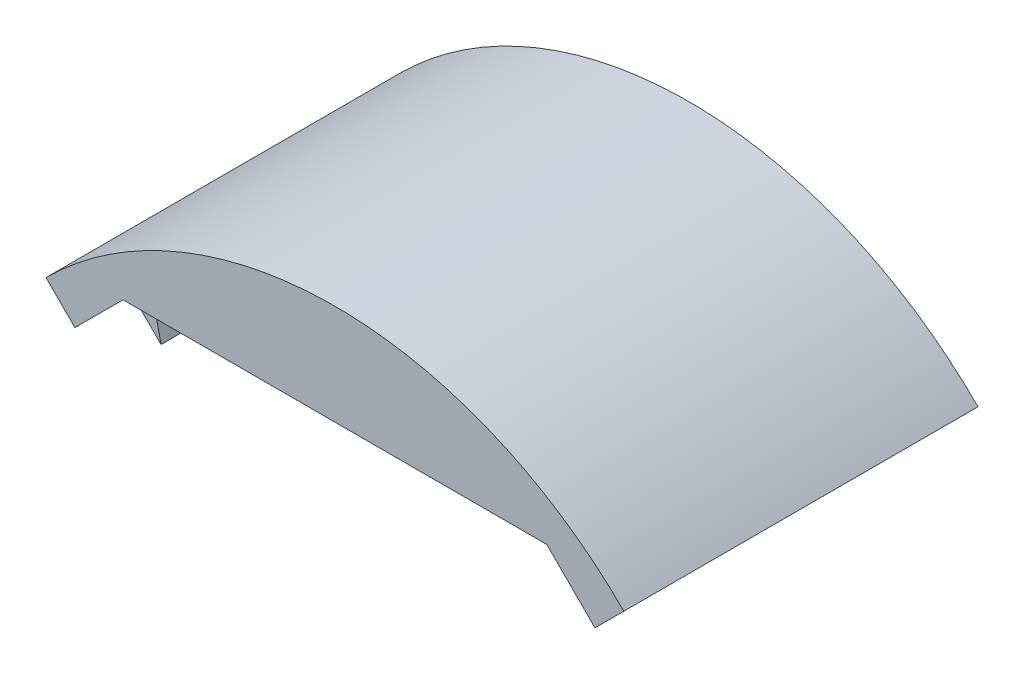
ISO-10303-21;
HEADER;
FILE_DESCRIPTION(('STEP AP214'),'2;1');
FILE_NAME('part.step','',(''),(''),'','','');
FILE_SCHEMA(('AUTOMOTIVE_DESIGN { 1 0 10303 214 1 1 1 1 }'));
ENDSEC;
DATA;
#1=APPLICATION_CONTEXT('core data for automotive mechanical design processes');
#2=APPLICATION_PROTOCOL_DEFINITION('international standard','automotive_design',2000,#1);
#3=PRODUCT_CONTEXT('',#1,'mechanical');
#4=PRODUCT('Part','Part','',(#3));
#5=PRODUCT_RELATED_PRODUCT_CATEGORY('part','',(#4));
#6=PRODUCT_DEFINITION_FORMATION('','',#4);
#7=PRODUCT_DEFINITION_CONTEXT('part definition',#1,'design');
#8=PRODUCT_DEFINITION('design','',#6,#7);
#9=PRODUCT_DEFINITION_SHAPE('','',#8);
#10=(LENGTH_UNIT() NAMED_UNIT(*) SI_UNIT(.MILLI.,.METRE.));
#11=(NAMED_UNIT(*) PLANE_ANGLE_UNIT() SI_UNIT($,.RADIAN.));
#12=(NAMED_UNIT(*) SI_UNIT($,.STERADIAN.) SOLID_ANGLE_UNIT());
#13=UNCERTAINTY_MEASURE_WITH_UNIT(LENGTH_MEASURE(1.E-05),#10,'distance_accuracy_value','');
#14=(GEOMETRIC_REPRESENTATION_CONTEXT(3) GLOBAL_UNCERTAINTY_ASSIGNED_CONTEXT((#13)) GLOBAL_UNIT_ASSIGNED_CONTEXT((#10,
#11,#12)) REPRESENTATION_CONTEXT('',''));
#15=CARTESIAN_POINT('',(0.,0.,0.));
#16=DIRECTION('',(0.,0.,1.));
#17=DIRECTION('',(1.,0.,0.));
#18=AXIS2_PLACEMENT_3D('',#15,#16,#17);
#19=CARTESIAN_POINT('',(0.,-19.5161471607487,64.0741382042982));
#20=DIRECTION('',(0.,0.,-1.));
#21=DIRECTION('',(-0.707106781186548,-0.707106781186547,0.));
#22=AXIS2_PLACEMENT_3D('',#19,#20,#21);
#23=CYLINDRICAL_SURFACE('',#22,25.8);
#24=DIRECTION('',(0.,0.,-1.));
#25=VECTOR('',#24,1.);
#26=CARTESIAN_POINT('',(-18.2433549546129,-1.27279220613579,64.0741382042982));
#27=LINE('',#26,#25);
#28=CARTESIAN_POINT('',(-18.2433549546129,-1.2727922061358,18.7));
#29=VERTEX_POINT('',#28);
#30=CARTESIAN_POINT('',(-18.2433549546129,-1.2727922061358,7.3));
#31=VERTEX_POINT('',#30);
#32=EDGE_CURVE('E382',#29,#31,#27,.T.);
#33=ORIENTED_EDGE('',*,*,#32,.T.);
#34=CARTESIAN_POINT('',(0.,-19.5161471607487,7.3));
#35=DIRECTION('',(0.,0.,-1.));
#36=DIRECTION('',(-0.707106781186548,0.707106781186547,0.));
#37=AXIS2_PLACEMENT_3D('',#34,#35,#36);
#38=CIRCLE('',#37,25.8);
#39=CARTESIAN_POINT('',(-17.300942303206,-0.376727226457697,7.3));
#40=VERTEX_POINT('',#39);
#41=EDGE_CURVE('E236',#31,#40,#38,.T.);
#42=ORIENTED_EDGE('',*,*,#41,.T.);
#43=DIRECTION('',(0.,0.,-1.));
#44=VECTOR('',#43,1.);
#45=CARTESIAN_POINT('',(-17.300942303206,-0.376727226457697,7.3));
#46=LINE('',#45,#44);
#47=CARTESIAN_POINT('',(-17.300942303206,-0.376727226457697,3.5));
#48=VERTEX_POINT('',#47);
#49=EDGE_CURVE('E404',#40,#48,#46,.T.);
#50=ORIENTED_EDGE('',*,*,#49,.T.);
#51=CARTESIAN_POINT('',(0.,-19.5161471607487,3.5));
#52=DIRECTION('',(0.,0.,-1.));
#53=DIRECTION('',(-0.707106781186548,0.707106781186547,0.));
#54=AXIS2_PLACEMENT_3D('',#51,#52,#53);
#55=CIRCLE('',#54,25.8);
#56=CARTESIAN_POINT('',(-18.2433549546129,-1.2727922061358,3.5));
#57=VERTEX_POINT('',#56);
#58=EDGE_CURVE('E388',#57,#48,#55,.T.);
#59=ORIENTED_EDGE('',*,*,#58,.F.);
#60=CARTESIAN_POINT('',(-18.2433549546129,-1.27279220613579,2.2));
#61=VERTEX_POINT('',#60);
#62=EDGE_CURVE('E371',#57,#61,#27,.T.);
#63=ORIENTED_EDGE('',*,*,#62,.T.);
#64=CARTESIAN_POINT('',(0.,-19.5161471607487,2.2));
#65=DIRECTION('',(0.,0.,1.));
#66=DIRECTION('',(0.707106781186548,0.707106781186547,0.));
#67=AXIS2_PLACEMENT_3D('',#64,#65,#66);
#68=CIRCLE('',#67,25.8);
#69=CARTESIAN_POINT('',(18.2433549546129,-1.27279220613579,2.2));
#70=VERTEX_POINT('',#69);
#71=EDGE_CURVE('E354',#70,#61,#68,.T.);
#72=ORIENTED_EDGE('',*,*,#71,.F.);
#73=DIRECTION('',(0.,0.,-1.));
#74=VECTOR('',#73,1.);
#75=CARTESIAN_POINT('',(18.2433549546129,-1.27279220613579,64.0741382042982));
#76=LINE('',#75,#74);
#77=CARTESIAN_POINT('',(18.2433549546129,-1.27279220613579,3.5));
#78=VERTEX_POINT('',#77);
#79=EDGE_CURVE('E373',#78,#70,#76,.T.);
#80=ORIENTED_EDGE('',*,*,#79,.F.);
#81=CARTESIAN_POINT('',(0.,-19.5161471607487,3.5));
#82=DIRECTION('',(0.,0.,1.));
#83=DIRECTION('',(0.707106781186548,0.707106781186547,0.));
#84=AXIS2_PLACEMENT_3D('',#81,#82,#83);
#85=CIRCLE('',#84,25.8);
#86=CARTESIAN_POINT('',(17.300942303206,-0.376727226457679,3.5));
#87=VERTEX_POINT('',#86);
#88=EDGE_CURVE('E457',#78,#87,#85,.T.);
#89=ORIENTED_EDGE('',*,*,#88,.T.);
#90=DIRECTION('',(0.,0.,-1.));
#91=VECTOR('',#90,1.);
#92=CARTESIAN_POINT('',(17.300942303206,-0.376727226457686,7.3));
#93=LINE('',#92,#91);
#94=CARTESIAN_POINT('',(17.300942303206,-0.376727226457683,7.3));
#95=VERTEX_POINT('',#94);
#96=EDGE_CURVE('E460',#95,#87,#93,.T.);
#97=ORIENTED_EDGE('',*,*,#96,.F.);
#98=CARTESIAN_POINT('',(0.,-19.5161471607487,7.3));
#99=DIRECTION('',(0.,0.,1.));
#100=DIRECTION('',(0.707106781186548,0.707106781186547,0.));
#101=AXIS2_PLACEMENT_3D('',#98,#99,#100);
#102=CIRCLE('',#101,25.8);
#103=CARTESIAN_POINT('',(18.2433549546129,-1.27279220613579,7.3));
#104=VERTEX_POINT('',#103);
#105=EDGE_CURVE('E443',#104,#95,#102,.T.);
#106=ORIENTED_EDGE('',*,*,#105,.F.);
#107=CARTESIAN_POINT('',(18.2433549546129,-1.27279220613579,18.7));
#108=VERTEX_POINT('',#107);
#109=EDGE_CURVE('E372',#108,#104,#76,.T.);
#110=ORIENTED_EDGE('',*,*,#109,.F.);
#111=CARTESIAN_POINT('',(0.,-19.5161471607487,18.7));
#112=DIRECTION('',(0.,0.,1.));
#113=DIRECTION('',(0.707106781186548,0.707106781186547,0.));
#114=AXIS2_PLACEMENT_3D('',#111,#112,#113);
#115=CIRCLE('',#114,25.8);
#116=CARTESIAN_POINT('',(17.300942303206,-0.376727226457683,18.7));
#117=VERTEX_POINT('',#116);
#118=EDGE_CURVE('E473',#108,#117,#115,.T.);
#119=ORIENTED_EDGE('',*,*,#118,.T.);
#120=DIRECTION('',(0.,0.,1.));
#121=VECTOR('',#120,1.);
#122=CARTESIAN_POINT('',(17.300942303206,-0.376727226457686,18.7));
#123=LINE('',#122,#121);
#124=CARTESIAN_POINT('',(17.300942303206,-0.376727226457686,22.5));
#125=VERTEX_POINT('',#124);
#126=EDGE_CURVE('E363',#117,#125,#123,.T.);
#127=ORIENTED_EDGE('',*,*,#126,.T.);
#128=CARTESIAN_POINT('',(0.,-19.5161471607487,22.5));
#129=DIRECTION('',(0.,0.,1.));
#130=DIRECTION('',(0.707106781186548,0.707106781186547,0.));
#131=AXIS2_PLACEMENT_3D('',#128,#129,#130);
#132=CIRCLE('',#131,25.8);
#133=CARTESIAN_POINT('',(18.2433549546129,-1.27279220613579,22.5));
#134=VERTEX_POINT('',#133);
#135=EDGE_CURVE('E486',#134,#125,#132,.T.);
#136=ORIENTED_EDGE('',*,*,#135,.F.);
#137=CARTESIAN_POINT('',(18.2433549546129,-1.27279220613579,24.));
#138=VERTEX_POINT('',#137);
#139=EDGE_CURVE('E366',#138,#134,#76,.T.);
#140=ORIENTED_EDGE('',*,*,#139,.F.);
#141=CARTESIAN_POINT('',(0.,-19.5161471607487,24.));
#142=DIRECTION('',(0.,0.,1.));
#143=DIRECTION('',(0.707106781186548,0.707106781186547,0.));
#144=AXIS2_PLACEMENT_3D('',#141,#142,#143);
#145=CIRCLE('',#144,25.8);
#146=CARTESIAN_POINT('',(-18.2433549546129,-1.27279220613579,24.));
#147=VERTEX_POINT('',#146);
#148=EDGE_CURVE('E357',#138,#147,#145,.T.);
#149=ORIENTED_EDGE('',*,*,#148,.T.);
#150=CARTESIAN_POINT('',(-18.2433549546129,-1.27279220613579,22.5));
#151=VERTEX_POINT('',#150);
#152=EDGE_CURVE('E262',#147,#151,#27,.T.);
#153=ORIENTED_EDGE('',*,*,#152,.T.);
#154=CARTESIAN_POINT('',(0.,-19.5161471607487,22.5));
#155=DIRECTION('',(0.,0.,-1.));
#156=DIRECTION('',(-0.707106781186548,0.707106781186547,0.));
#157=AXIS2_PLACEMENT_3D('',#154,#155,#156);
#158=CIRCLE('',#157,25.8);
#159=CARTESIAN_POINT('',(-17.300942303206,-0.376727226457697,22.5));
#160=VERTEX_POINT('',#159);
#161=EDGE_CURVE('E41',#151,#160,#158,.T.);
#162=ORIENTED_EDGE('',*,*,#161,.T.);
#163=DIRECTION('',(0.,0.,1.));
#164=VECTOR('',#163,1.);
#165=CARTESIAN_POINT('',(-17.300942303206,-0.376727226457697,18.7));
#166=LINE('',#165,#164);
#167=CARTESIAN_POINT('',(-17.300942303206,-0.376727226457697,18.7));
#168=VERTEX_POINT('',#167);
#169=EDGE_CURVE('E426',#168,#160,#166,.T.);
#170=ORIENTED_EDGE('',*,*,#169,.F.);
#171=CARTESIAN_POINT('',(0.,-19.5161471607487,18.7));
#172=DIRECTION('',(0.,0.,-1.));
#173=DIRECTION('',(-0.707106781186548,0.707106781186547,0.));
#174=AXIS2_PLACEMENT_3D('',#171,#172,#173);
#175=CIRCLE('',#174,25.8);
#176=EDGE_CURVE('E414',#29,#168,#175,.T.);
#177=ORIENTED_EDGE('',*,*,#176,.F.);
#178=EDGE_LOOP('',(#33,#42,#50,#59,#63,#72,#80,#89,#97,#106,#110,#119,#127,#136,#140,#149,#153,
#162,#170,#177));
#179=FACE_BOUND('',#178,.T.);
#180=ADVANCED_FACE('F18',(#179),#23,.F.);
#181=CARTESIAN_POINT('',(-19.0918830920368,-3.53553390593274,26.));
#182=DIRECTION('',(-0.707106781186547,0.707106781186547,0.));
#183=DIRECTION('',(0.,0.,1.));
#184=AXIS2_PLACEMENT_3D('',#181,#182,#183);
#185=PLANE('',#184);
#186=DIRECTION('',(0.707106781186547,0.707106781186548,0.));
#187=VECTOR('',#186,1.);
#188=CARTESIAN_POINT('',(-17.5362481734264,-1.97989898732235,7.3));
#189=LINE('',#188,#187);
#190=CARTESIAN_POINT('',(-18.3847763108502,-2.8284271247462,7.3));
#191=VERTEX_POINT('',#190);
#192=CARTESIAN_POINT('',(-17.5362481734264,-1.97989898732235,7.3));
#193=VERTEX_POINT('',#192);
#194=EDGE_CURVE('E232',#191,#193,#189,.T.);
#195=ORIENTED_EDGE('',*,*,#194,.T.);
#196=DIRECTION('',(0.,0.,-1.));
#197=VECTOR('',#196,1.);
#198=CARTESIAN_POINT('',(-17.5362481734264,-1.97989898732234,64.0741382042982));
#199=LINE('',#198,#197);
#200=CARTESIAN_POINT('',(-17.5362481734264,-1.97989898732235,18.7));
#201=VERTEX_POINT('',#200);
#202=EDGE_CURVE('E247',#201,#193,#199,.T.);
#203=ORIENTED_EDGE('',*,*,#202,.F.);
#204=DIRECTION('',(0.707106781186547,0.707106781186548,0.));
#205=VECTOR('',#204,1.);
#206=CARTESIAN_POINT('',(-17.5362481734264,-1.97989898732235,18.7));
#207=LINE('',#206,#205);
#208=CARTESIAN_POINT('',(-18.3847763108502,-2.8284271247462,18.7));
#209=VERTEX_POINT('',#208);
#210=EDGE_CURVE('E407',#209,#201,#207,.T.);
#211=ORIENTED_EDGE('',*,*,#210,.F.);
#212=DIRECTION('',(0.,0.,1.));
#213=VECTOR('',#212,1.);
#214=CARTESIAN_POINT('',(-18.3847763108502,-2.8284271247462,18.7));
#215=LINE('',#214,#213);
#216=CARTESIAN_POINT('',(-18.3847763108502,-2.8284271247462,22.5));
#217=VERTEX_POINT('',#216);
#218=EDGE_CURVE('E417',#209,#217,#215,.T.);
#219=ORIENTED_EDGE('',*,*,#218,.T.);
#220=DIRECTION('',(0.707106781186547,0.707106781186548,0.));
#221=VECTOR('',#220,1.);
#222=CARTESIAN_POINT('',(-17.5362481734264,-1.97989898732235,22.5));
#223=LINE('',#222,#221);
#224=CARTESIAN_POINT('',(-17.5362481734264,-1.97989898732235,22.5));
#225=VERTEX_POINT('',#224);
#226=EDGE_CURVE('E401',#217,#225,#223,.T.);
#227=ORIENTED_EDGE('',*,*,#226,.T.);
#228=CARTESIAN_POINT('',(-17.5362481734264,-1.97989898732234,24.));
#229=VERTEX_POINT('',#228);
#230=EDGE_CURVE('E254',#229,#225,#199,.T.);
#231=ORIENTED_EDGE('',*,*,#230,.F.);
#232=DIRECTION('',(0.707106781186548,0.707106781186547,0.));
#233=VECTOR('',#232,1.);
#234=CARTESIAN_POINT('',(-19.0918830920368,-3.53553390593274,24.));
#235=LINE('',#234,#233);
#236=CARTESIAN_POINT('',(-15.556349186104,0.,24.));
#237=VERTEX_POINT('',#236);
#238=EDGE_CURVE('E283',#229,#237,#235,.T.);
#239=ORIENTED_EDGE('',*,*,#238,.T.);
#240=DIRECTION('',(0.,0.,-1.));
#241=VECTOR('',#240,1.);
#242=CARTESIAN_POINT('',(-15.556349186104,0.,26.));
#243=LINE('',#242,#241);
#244=CARTESIAN_POINT('',(-15.556349186104,0.,26.));
#245=VERTEX_POINT('',#244);
#246=EDGE_CURVE('E325',#245,#237,#243,.T.);
#247=ORIENTED_EDGE('',*,*,#246,.F.);
#248=DIRECTION('',(0.707106781186548,0.707106781186547,0.));
#249=VECTOR('',#248,1.);
#250=CARTESIAN_POINT('',(-19.0918830920368,-3.53553390593274,26.));
#251=LINE('',#250,#249);
#252=CARTESIAN_POINT('',(-19.0918830920368,-3.53553390593274,26.));
#253=VERTEX_POINT('',#252);
#254=EDGE_CURVE('E293',#253,#245,#251,.T.);
#255=ORIENTED_EDGE('',*,*,#254,.F.);
#256=DIRECTION('',(0.,0.,-1.));
#257=VECTOR('',#256,1.);
#258=CARTESIAN_POINT('',(-19.0918830920368,-3.53553390593274,26.));
#259=LINE('',#258,#257);
#260=CARTESIAN_POINT('',(-19.0918830920368,-3.53553390593274,0.));
#261=VERTEX_POINT('',#260);
#262=EDGE_CURVE('E26',#253,#261,#259,.T.);
#263=ORIENTED_EDGE('',*,*,#262,.T.);
#264=DIRECTION('',(0.707106781186548,0.707106781186547,0.));
#265=VECTOR('',#264,1.);
#266=CARTESIAN_POINT('',(-19.0918830920368,-3.53553390593274,0.));
#267=LINE('',#266,#265);
#268=CARTESIAN_POINT('',(-15.556349186104,0.,0.));
#269=VERTEX_POINT('',#268);
#270=EDGE_CURVE('E306',#261,#269,#267,.T.);
#271=ORIENTED_EDGE('',*,*,#270,.T.);
#272=CARTESIAN_POINT('',(-15.556349186104,0.,2.2));
#273=VERTEX_POINT('',#272);
#274=EDGE_CURVE('E324',#273,#269,#243,.T.);
#275=ORIENTED_EDGE('',*,*,#274,.F.);
#276=DIRECTION('',(0.707106781186548,0.707106781186547,0.));
#277=VECTOR('',#276,1.);
#278=CARTESIAN_POINT('',(-19.0918830920368,-3.53553390593274,2.2));
#279=LINE('',#278,#277);
#280=CARTESIAN_POINT('',(-17.5362481734264,-1.97989898732234,2.2));
#281=VERTEX_POINT('',#280);
#282=EDGE_CURVE('E275',#281,#273,#279,.T.);
#283=ORIENTED_EDGE('',*,*,#282,.F.);
#284=CARTESIAN_POINT('',(-17.5362481734264,-1.97989898732234,3.5));
#285=VERTEX_POINT('',#284);
#286=EDGE_CURVE('E255',#285,#281,#199,.T.);
#287=ORIENTED_EDGE('',*,*,#286,.F.);
#288=DIRECTION('',(0.707106781186547,0.707106781186548,0.));
#289=VECTOR('',#288,1.);
#290=CARTESIAN_POINT('',(-17.5362481734264,-1.97989898732235,3.5));
#291=LINE('',#290,#289);
#292=CARTESIAN_POINT('',(-18.3847763108502,-2.8284271247462,3.5));
#293=VERTEX_POINT('',#292);
#294=EDGE_CURVE('E33',#293,#285,#291,.T.);
#295=ORIENTED_EDGE('',*,*,#294,.F.);
#296=DIRECTION('',(0.,0.,-1.));
#297=VECTOR('',#296,1.);
#298=CARTESIAN_POINT('',(-18.3847763108502,-2.8284271247462,7.3));
#299=LINE('',#298,#297);
#300=EDGE_CURVE('E248',#191,#293,#299,.T.);
#301=ORIENTED_EDGE('',*,*,#300,.F.);
#302=EDGE_LOOP('',(#195,#203,#211,#219,#227,#231,#239,#247,#255,#263,#271,#275,#283,#287,#295,#301));
#303=FACE_BOUND('',#302,.T.);
#304=ADVANCED_FACE('F245',(#303),#185,.F.);
#305=CARTESIAN_POINT('',(1.5556349186104,-21.0717820793591,64.0741382042982));
#306=DIRECTION('',(-0.707106781186548,-0.707106781186547,0.));
#307=DIRECTION('',(0.,0.,1.));
#308=AXIS2_PLACEMENT_3D('',#305,#306,#307);
#309=PLANE('',#308);
#310=DIRECTION('',(-0.707106781186547,0.707106781186548,0.));
#311=VECTOR('',#310,1.);
#312=CARTESIAN_POINT('',(-17.5362481734264,-1.97989898732235,7.3));
#313=LINE('',#312,#311);
#314=EDGE_CURVE('E228',#193,#31,#313,.T.);
#315=ORIENTED_EDGE('',*,*,#314,.T.);
#316=ORIENTED_EDGE('',*,*,#32,.F.);
#317=DIRECTION('',(-0.707106781186547,0.707106781186548,0.));
#318=VECTOR('',#317,1.);
#319=CARTESIAN_POINT('',(-17.5362481734264,-1.97989898732235,18.7));
#320=LINE('',#319,#318);
#321=EDGE_CURVE('E253',#201,#29,#320,.T.);
#322=ORIENTED_EDGE('',*,*,#321,.F.);
#323=ORIENTED_EDGE('',*,*,#202,.T.);
#324=EDGE_LOOP('',(#315,#316,#322,#323));
#325=FACE_BOUND('',#324,.T.);
#326=ADVANCED_FACE('F252',(#325),#309,.F.);
#327=ORIENTED_EDGE('',*,*,#62,.F.);
#328=DIRECTION('',(-0.707106781186547,0.707106781186548,0.));
#329=VECTOR('',#328,1.);
#330=CARTESIAN_POINT('',(-17.5362481734264,-1.97989898732235,3.5));
#331=LINE('',#330,#329);
#332=EDGE_CURVE('E390',#285,#57,#331,.T.);
#333=ORIENTED_EDGE('',*,*,#332,.F.);
#334=ORIENTED_EDGE('',*,*,#286,.T.);
#335=DIRECTION('',(-0.707106781186547,0.707106781186548,0.));
#336=VECTOR('',#335,1.);
#337=CARTESIAN_POINT('',(1.5556349186104,-21.0717820793591,2.2));
#338=LINE('',#337,#336);
#339=EDGE_CURVE('E259',#281,#61,#338,.T.);
#340=ORIENTED_EDGE('',*,*,#339,.T.);
#341=EDGE_LOOP('',(#327,#333,#334,#340));
#342=FACE_BOUND('',#341,.T.);
#343=ADVANCED_FACE('F389',(#342),#309,.F.);
#344=CARTESIAN_POINT('',(19.0918830920368,-3.53553390593274,26.));
#345=DIRECTION('',(0.707106781186547,0.707106781186547,0.));
#346=DIRECTION('',(0.,0.,-1.));
#347=AXIS2_PLACEMENT_3D('',#344,#345,#346);
#348=PLANE('',#347);
#349=DIRECTION('',(-0.707106781186547,0.707106781186548,0.));
#350=VECTOR('',#349,1.);
#351=CARTESIAN_POINT('',(17.5362481734264,-1.97989898732234,7.3));
#352=LINE('',#351,#350);
#353=CARTESIAN_POINT('',(18.3847763108502,-2.82842712474619,7.3));
#354=VERTEX_POINT('',#353);
#355=CARTESIAN_POINT('',(17.5362481734264,-1.97989898732234,7.3));
#356=VERTEX_POINT('',#355);
#357=EDGE_CURVE('E434',#354,#356,#352,.T.);
#358=ORIENTED_EDGE('',*,*,#357,.F.);
#359=DIRECTION('',(0.,0.,-1.));
#360=VECTOR('',#359,1.);
#361=CARTESIAN_POINT('',(18.3847763108502,-2.82842712474619,7.3));
#362=LINE('',#361,#360);
#363=CARTESIAN_POINT('',(18.3847763108502,-2.82842712474619,3.5));
#364=VERTEX_POINT('',#363);
#365=EDGE_CURVE('E449',#354,#364,#362,.T.);
#366=ORIENTED_EDGE('',*,*,#365,.T.);
#367=DIRECTION('',(-0.707106781186547,0.707106781186548,0.));
#368=VECTOR('',#367,1.);
#369=CARTESIAN_POINT('',(17.5362481734264,-1.97989898732234,3.5));
#370=LINE('',#369,#368);
#371=CARTESIAN_POINT('',(17.5362481734264,-1.97989898732234,3.5));
#372=VERTEX_POINT('',#371);
#373=EDGE_CURVE('E428',#364,#372,#370,.T.);
#374=ORIENTED_EDGE('',*,*,#373,.T.);
#375=DIRECTION('',(0.,0.,-1.));
#376=VECTOR('',#375,1.);
#377=CARTESIAN_POINT('',(17.5362481734264,-1.97989898732234,64.0741382042982));
#378=LINE('',#377,#376);
#379=CARTESIAN_POINT('',(17.5362481734264,-1.97989898732234,2.2));
#380=VERTEX_POINT('',#379);
#381=EDGE_CURVE('E269',#372,#380,#378,.T.);
#382=ORIENTED_EDGE('',*,*,#381,.T.);
#383=DIRECTION('',(0.707106781186547,-0.707106781186548,0.));
#384=VECTOR('',#383,1.);
#385=CARTESIAN_POINT('',(19.0918830920368,-3.53553390593274,2.2));
#386=LINE('',#385,#384);
#387=CARTESIAN_POINT('',(15.556349186104,0.,2.2));
#388=VERTEX_POINT('',#387);
#389=EDGE_CURVE('E270',#388,#380,#386,.T.);
#390=ORIENTED_EDGE('',*,*,#389,.F.);
#391=DIRECTION('',(0.,0.,-1.));
#392=VECTOR('',#391,1.);
#393=CARTESIAN_POINT('',(15.556349186104,0.,26.));
#394=LINE('',#393,#392);
#395=CARTESIAN_POINT('',(15.556349186104,0.,0.));
#396=VERTEX_POINT('',#395);
#397=EDGE_CURVE('E320',#388,#396,#394,.T.);
#398=ORIENTED_EDGE('',*,*,#397,.T.);
#399=DIRECTION('',(0.707106781186547,-0.707106781186548,0.));
#400=VECTOR('',#399,1.);
#401=CARTESIAN_POINT('',(19.0918830920368,-3.53553390593274,0.));
#402=LINE('',#401,#400);
#403=CARTESIAN_POINT('',(19.0918830920368,-3.53553390593274,0.));
#404=VERTEX_POINT('',#403);
#405=EDGE_CURVE('E312',#396,#404,#402,.T.);
#406=ORIENTED_EDGE('',*,*,#405,.T.);
#407=DIRECTION('',(0.,0.,-1.));
#408=VECTOR('',#407,1.);
#409=CARTESIAN_POINT('',(19.0918830920368,-3.53553390593274,26.));
#410=LINE('',#409,#408);
#411=CARTESIAN_POINT('',(19.0918830920368,-3.53553390593274,26.));
#412=VERTEX_POINT('',#411);
#413=EDGE_CURVE('E318',#412,#404,#410,.T.);
#414=ORIENTED_EDGE('',*,*,#413,.F.);
#415=DIRECTION('',(0.707106781186547,-0.707106781186548,0.));
#416=VECTOR('',#415,1.);
#417=CARTESIAN_POINT('',(19.0918830920368,-3.53553390593274,26.));
#418=LINE('',#417,#416);
#419=CARTESIAN_POINT('',(15.556349186104,0.,26.));
#420=VERTEX_POINT('',#419);
#421=EDGE_CURVE('E297',#420,#412,#418,.T.);
#422=ORIENTED_EDGE('',*,*,#421,.F.);
#423=CARTESIAN_POINT('',(15.556349186104,0.,24.));
#424=VERTEX_POINT('',#423);
#425=EDGE_CURVE('E321',#420,#424,#394,.T.);
#426=ORIENTED_EDGE('',*,*,#425,.T.);
#427=DIRECTION('',(0.707106781186547,-0.707106781186548,0.));
#428=VECTOR('',#427,1.);
#429=CARTESIAN_POINT('',(19.0918830920368,-3.53553390593274,24.));
#430=LINE('',#429,#428);
#431=CARTESIAN_POINT('',(17.5362481734264,-1.97989898732234,24.));
#432=VERTEX_POINT('',#431);
#433=EDGE_CURVE('E277',#424,#432,#430,.T.);
#434=ORIENTED_EDGE('',*,*,#433,.T.);
#435=CARTESIAN_POINT('',(17.5362481734264,-1.97989898732234,22.5));
#436=VERTEX_POINT('',#435);
#437=EDGE_CURVE('E264',#432,#436,#378,.T.);
#438=ORIENTED_EDGE('',*,*,#437,.T.);
#439=DIRECTION('',(-0.707106781186547,0.707106781186548,0.));
#440=VECTOR('',#439,1.);
#441=CARTESIAN_POINT('',(17.5362481734264,-1.97989898732234,22.5));
#442=LINE('',#441,#440);
#443=CARTESIAN_POINT('',(18.3847763108502,-2.82842712474619,22.5));
#444=VERTEX_POINT('',#443);
#445=EDGE_CURVE('E463',#444,#436,#442,.T.);
#446=ORIENTED_EDGE('',*,*,#445,.F.);
#447=DIRECTION('',(0.,0.,1.));
#448=VECTOR('',#447,1.);
#449=CARTESIAN_POINT('',(18.3847763108502,-2.82842712474619,18.7));
#450=LINE('',#449,#448);
#451=CARTESIAN_POINT('',(18.3847763108502,-2.82842712474619,18.7));
#452=VERTEX_POINT('',#451);
#453=EDGE_CURVE('E368',#452,#444,#450,.T.);
#454=ORIENTED_EDGE('',*,*,#453,.F.);
#455=DIRECTION('',(-0.707106781186547,0.707106781186548,0.));
#456=VECTOR('',#455,1.);
#457=CARTESIAN_POINT('',(17.5362481734264,-1.97989898732234,18.7));
#458=LINE('',#457,#456);
#459=CARTESIAN_POINT('',(17.5362481734264,-1.97989898732234,18.7));
#460=VERTEX_POINT('',#459);
#461=EDGE_CURVE('E468',#452,#460,#458,.T.);
#462=ORIENTED_EDGE('',*,*,#461,.T.);
#463=EDGE_CURVE('E268',#460,#356,#378,.T.);
#464=ORIENTED_EDGE('',*,*,#463,.T.);
#465=EDGE_LOOP('',(#358,#366,#374,#382,#390,#398,#406,#414,#422,#426,#434,#438,#446,#454,#462,#464));
#466=FACE_BOUND('',#465,.T.);
#467=ADVANCED_FACE('F509',(#466),#348,.F.);
#468=CARTESIAN_POINT('',(-1.55563491861041,-21.0717820793591,64.0741382042982));
#469=DIRECTION('',(-0.707106781186547,0.707106781186548,0.));
#470=DIRECTION('',(0.,0.,1.));
#471=AXIS2_PLACEMENT_3D('',#468,#469,#470);
#472=PLANE('',#471);
#473=ORIENTED_EDGE('',*,*,#109,.T.);
#474=DIRECTION('',(0.707106781186547,0.707106781186548,0.));
#475=VECTOR('',#474,1.);
#476=CARTESIAN_POINT('',(17.5362481734264,-1.97989898732234,7.3));
#477=LINE('',#476,#475);
#478=EDGE_CURVE('E446',#356,#104,#477,.T.);
#479=ORIENTED_EDGE('',*,*,#478,.F.);
#480=ORIENTED_EDGE('',*,*,#463,.F.);
#481=DIRECTION('',(0.707106781186547,0.707106781186548,0.));
#482=VECTOR('',#481,1.);
#483=CARTESIAN_POINT('',(17.5362481734264,-1.97989898732234,18.7));
#484=LINE('',#483,#482);
#485=EDGE_CURVE('E470',#460,#108,#484,.T.);
#486=ORIENTED_EDGE('',*,*,#485,.T.);
#487=EDGE_LOOP('',(#473,#479,#480,#486));
#488=FACE_BOUND('',#487,.T.);
#489=ADVANCED_FACE('F573',(#488),#472,.T.);
#490=DIRECTION('',(0.707106781186547,0.707106781186548,0.));
#491=VECTOR('',#490,1.);
#492=CARTESIAN_POINT('',(17.5362481734264,-1.97989898732234,3.5));
#493=LINE('',#492,#491);
#494=EDGE_CURVE('E438',#372,#78,#493,.T.);
#495=ORIENTED_EDGE('',*,*,#494,.T.);
#496=ORIENTED_EDGE('',*,*,#79,.T.);
#497=DIRECTION('',(0.707106781186548,0.707106781186547,0.));
#498=VECTOR('',#497,1.);
#499=CARTESIAN_POINT('',(-1.55563491861041,-21.0717820793591,2.2));
#500=LINE('',#499,#498);
#501=EDGE_CURVE('E267',#380,#70,#500,.T.);
#502=ORIENTED_EDGE('',*,*,#501,.F.);
#503=ORIENTED_EDGE('',*,*,#381,.F.);
#504=EDGE_LOOP('',(#495,#496,#502,#503));
#505=FACE_BOUND('',#504,.T.);
#506=ADVANCED_FACE('F586',(#505),#472,.T.);
#507=CARTESIAN_POINT('',(-15.556349186104,0.,26.));
#508=DIRECTION('',(0.,1.,0.));
#509=DIRECTION('',(-1.,0.,0.));
#510=AXIS2_PLACEMENT_3D('',#507,#508,#509);
#511=PLANE('',#510);
#512=DIRECTION('',(1.,0.,0.));
#513=VECTOR('',#512,1.);
#514=CARTESIAN_POINT('',(-15.556349186104,0.,2.2));
#515=LINE('',#514,#513);
#516=EDGE_CURVE('E273',#273,#388,#515,.T.);
#517=ORIENTED_EDGE('',*,*,#516,.F.);
#518=ORIENTED_EDGE('',*,*,#274,.T.);
#519=DIRECTION('',(1.,0.,0.));
#520=VECTOR('',#519,1.);
#521=CARTESIAN_POINT('',(-15.556349186104,0.,0.));
#522=LINE('',#521,#520);
#523=EDGE_CURVE('E309',#269,#396,#522,.T.);
#524=ORIENTED_EDGE('',*,*,#523,.T.);
#525=ORIENTED_EDGE('',*,*,#397,.F.);
#526=EDGE_LOOP('',(#517,#518,#524,#525));
#527=FACE_BOUND('',#526,.T.);
#528=ADVANCED_FACE('F343',(#527),#511,.F.);
#529=CARTESIAN_POINT('',(0.,-22.6274169979695,26.));
#530=DIRECTION('',(0.,0.,-1.));
#531=DIRECTION('',(-0.707106781186548,-0.707106781186547,0.));
#532=AXIS2_PLACEMENT_3D('',#529,#530,#531);
#533=CYLINDRICAL_SURFACE('',#532,30.);
#534=CARTESIAN_POINT('',(0.,-22.6274169979695,0.));
#535=DIRECTION('',(0.,0.,1.));
#536=DIRECTION('',(0.707106781186548,0.707106781186547,0.));
#537=AXIS2_PLACEMENT_3D('',#534,#535,#536);
#538=CIRCLE('',#537,30.);
#539=CARTESIAN_POINT('',(21.2132034355964,-1.4142135623731,0.));
#540=VERTEX_POINT('',#539);
#541=CARTESIAN_POINT('',(-21.2132034355964,-1.4142135623731,0.));
#542=VERTEX_POINT('',#541);
#543=EDGE_CURVE('E286',#540,#542,#538,.T.);
#544=ORIENTED_EDGE('',*,*,#543,.T.);
#545=DIRECTION('',(0.,0.,-1.));
#546=VECTOR('',#545,1.);
#547=CARTESIAN_POINT('',(-21.2132034355964,-1.4142135623731,26.));
#548=LINE('',#547,#546);
#549=CARTESIAN_POINT('',(-21.2132034355964,-1.4142135623731,26.));
#550=VERTEX_POINT('',#549);
#551=EDGE_CURVE('E11',#550,#542,#548,.T.);
#552=ORIENTED_EDGE('',*,*,#551,.F.);
#553=CARTESIAN_POINT('',(0.,-22.6274169979695,26.));
#554=DIRECTION('',(0.,0.,1.));
#555=DIRECTION('',(0.707106781186548,0.707106781186547,0.));
#556=AXIS2_PLACEMENT_3D('',#553,#554,#555);
#557=CIRCLE('',#556,30.);
#558=CARTESIAN_POINT('',(21.2132034355964,-1.4142135623731,26.));
#559=VERTEX_POINT('',#558);
#560=EDGE_CURVE('E287',#559,#550,#557,.T.);
#561=ORIENTED_EDGE('',*,*,#560,.F.);
#562=DIRECTION('',(0.,0.,-1.));
#563=VECTOR('',#562,1.);
#564=CARTESIAN_POINT('',(21.2132034355964,-1.4142135623731,26.));
#565=LINE('',#564,#563);
#566=EDGE_CURVE('E301',#559,#540,#565,.T.);
#567=ORIENTED_EDGE('',*,*,#566,.T.);
#568=EDGE_LOOP('',(#544,#552,#561,#567));
#569=FACE_BOUND('',#568,.T.);
#570=ADVANCED_FACE('F20',(#569),#533,.T.);
#571=CARTESIAN_POINT('',(-21.2132034355964,-1.4142135623731,26.));
#572=DIRECTION('',(0.707106781186547,0.707106781186547,0.));
#573=DIRECTION('',(-0.707106781186548,0.707106781186547,0.));
#574=AXIS2_PLACEMENT_3D('',#571,#572,#573);
#575=PLANE('',#574);
#576=DIRECTION('',(0.707106781186548,-0.707106781186547,0.));
#577=VECTOR('',#576,1.);
#578=CARTESIAN_POINT('',(-21.2132034355964,-1.4142135623731,0.));
#579=LINE('',#578,#577);
#580=EDGE_CURVE('E304',#542,#261,#579,.T.);
#581=ORIENTED_EDGE('',*,*,#580,.T.);
#582=ORIENTED_EDGE('',*,*,#262,.F.);
#583=DIRECTION('',(0.707106781186548,-0.707106781186547,0.));
#584=VECTOR('',#583,1.);
#585=CARTESIAN_POINT('',(-21.2132034355964,-1.4142135623731,26.));
#586=LINE('',#585,#584);
#587=EDGE_CURVE('E290',#550,#253,#586,.T.);
#588=ORIENTED_EDGE('',*,*,#587,.F.);
#589=ORIENTED_EDGE('',*,*,#551,.T.);
#590=EDGE_LOOP('',(#581,#582,#588,#589));
#591=FACE_BOUND('',#590,.T.);
#592=ADVANCED_FACE('F575',(#591),#575,.F.);
#593=ORIENTED_EDGE('',*,*,#246,.T.);
#594=DIRECTION('',(1.,0.,0.));
#595=VECTOR('',#594,1.);
#596=CARTESIAN_POINT('',(-15.556349186104,0.,24.));
#597=LINE('',#596,#595);
#598=EDGE_CURVE('E280',#237,#424,#597,.T.);
#599=ORIENTED_EDGE('',*,*,#598,.T.);
#600=ORIENTED_EDGE('',*,*,#425,.F.);
#601=DIRECTION('',(1.,0.,0.));
#602=VECTOR('',#601,1.);
#603=CARTESIAN_POINT('',(-15.556349186104,0.,26.));
#604=LINE('',#603,#602);
#605=EDGE_CURVE('E295',#245,#420,#604,.T.);
#606=ORIENTED_EDGE('',*,*,#605,.F.);
#607=EDGE_LOOP('',(#593,#599,#600,#606));
#608=FACE_BOUND('',#607,.T.);
#609=ADVANCED_FACE('F516',(#608),#511,.F.);
#610=CARTESIAN_POINT('',(21.2132034355964,-1.4142135623731,26.));
#611=DIRECTION('',(-0.707106781186547,0.707106781186547,0.));
#612=DIRECTION('',(-0.707106781186547,-0.707106781186548,0.));
#613=AXIS2_PLACEMENT_3D('',#610,#611,#612);
#614=PLANE('',#613);
#615=DIRECTION('',(0.707106781186547,0.707106781186548,0.));
#616=VECTOR('',#615,1.);
#617=CARTESIAN_POINT('',(21.2132034355964,-1.4142135623731,0.));
#618=LINE('',#617,#616);
#619=EDGE_CURVE('E291',#404,#540,#618,.T.);
#620=ORIENTED_EDGE('',*,*,#619,.T.);
#621=ORIENTED_EDGE('',*,*,#566,.F.);
#622=DIRECTION('',(0.707106781186547,0.707106781186548,0.));
#623=VECTOR('',#622,1.);
#624=CARTESIAN_POINT('',(21.2132034355964,-1.4142135623731,26.));
#625=LINE('',#624,#623);
#626=EDGE_CURVE('E299',#412,#559,#625,.T.);
#627=ORIENTED_EDGE('',*,*,#626,.F.);
#628=ORIENTED_EDGE('',*,*,#413,.T.);
#629=EDGE_LOOP('',(#620,#621,#627,#628));
#630=FACE_BOUND('',#629,.T.);
#631=ADVANCED_FACE('F564',(#630),#614,.F.);
#632=CARTESIAN_POINT('',(0.,-22.6274169979695,26.));
#633=DIRECTION('',(0.,0.,1.));
#634=DIRECTION('',(0.707106781186548,0.707106781186547,0.));
#635=AXIS2_PLACEMENT_3D('',#632,#633,#634);
#636=PLANE('',#635);
#637=ORIENTED_EDGE('',*,*,#560,.T.);
#638=ORIENTED_EDGE('',*,*,#587,.T.);
#639=ORIENTED_EDGE('',*,*,#254,.T.);
#640=ORIENTED_EDGE('',*,*,#605,.T.);
#641=ORIENTED_EDGE('',*,*,#421,.T.);
#642=ORIENTED_EDGE('',*,*,#626,.T.);
#643=EDGE_LOOP('',(#637,#638,#639,#640,#641,#642));
#644=FACE_BOUND('',#643,.T.);
#645=ADVANCED_FACE('F561',(#644),#636,.T.);
#646=CARTESIAN_POINT('',(0.,-22.6274169979695,0.));
#647=DIRECTION('',(0.,0.,1.));
#648=DIRECTION('',(0.707106781186548,0.707106781186547,0.));
#649=AXIS2_PLACEMENT_3D('',#646,#647,#648);
#650=PLANE('',#649);
#651=ORIENTED_EDGE('',*,*,#543,.F.);
#652=ORIENTED_EDGE('',*,*,#619,.F.);
#653=ORIENTED_EDGE('',*,*,#405,.F.);
#654=ORIENTED_EDGE('',*,*,#523,.F.);
#655=ORIENTED_EDGE('',*,*,#270,.F.);
#656=ORIENTED_EDGE('',*,*,#580,.F.);
#657=EDGE_LOOP('',(#651,#652,#653,#654,#655,#656));
#658=FACE_BOUND('',#657,.T.);
#659=ADVANCED_FACE('F337',(#658),#650,.F.);
#660=CARTESIAN_POINT('',(0.,-22.6274169979695,24.));
#661=DIRECTION('',(0.,0.,1.));
#662=DIRECTION('',(0.707106781186548,0.707106781186547,0.));
#663=AXIS2_PLACEMENT_3D('',#660,#661,#662);
#664=PLANE('',#663);
#665=DIRECTION('',(-0.707106781186547,0.707106781186548,0.));
#666=VECTOR('',#665,1.);
#667=CARTESIAN_POINT('',(1.5556349186104,-21.0717820793591,24.));
#668=LINE('',#667,#666);
#669=EDGE_CURVE('E258',#229,#147,#668,.T.);
#670=ORIENTED_EDGE('',*,*,#669,.T.);
#671=ORIENTED_EDGE('',*,*,#148,.F.);
#672=DIRECTION('',(0.707106781186548,0.707106781186547,0.));
#673=VECTOR('',#672,1.);
#674=CARTESIAN_POINT('',(-1.55563491861041,-21.0717820793591,24.));
#675=LINE('',#674,#673);
#676=EDGE_CURVE('E359',#432,#138,#675,.T.);
#677=ORIENTED_EDGE('',*,*,#676,.F.);
#678=ORIENTED_EDGE('',*,*,#433,.F.);
#679=ORIENTED_EDGE('',*,*,#598,.F.);
#680=ORIENTED_EDGE('',*,*,#238,.F.);
#681=EDGE_LOOP('',(#670,#671,#677,#678,#679,#680));
#682=FACE_BOUND('',#681,.T.);
#683=ADVANCED_FACE('F513',(#682),#664,.F.);
#684=CARTESIAN_POINT('',(0.,-22.6274169979695,2.2));
#685=DIRECTION('',(0.,0.,1.));
#686=DIRECTION('',(0.707106781186548,0.707106781186547,0.));
#687=AXIS2_PLACEMENT_3D('',#684,#685,#686);
#688=PLANE('',#687);
#689=ORIENTED_EDGE('',*,*,#282,.T.);
#690=ORIENTED_EDGE('',*,*,#516,.T.);
#691=ORIENTED_EDGE('',*,*,#389,.T.);
#692=ORIENTED_EDGE('',*,*,#501,.T.);
#693=ORIENTED_EDGE('',*,*,#71,.T.);
#694=ORIENTED_EDGE('',*,*,#339,.F.);
#695=EDGE_LOOP('',(#689,#690,#691,#692,#693,#694));
#696=FACE_BOUND('',#695,.T.);
#697=ADVANCED_FACE('F348',(#696),#688,.T.);
#698=ORIENTED_EDGE('',*,*,#230,.T.);
#699=DIRECTION('',(-0.707106781186547,0.707106781186548,0.));
#700=VECTOR('',#699,1.);
#701=CARTESIAN_POINT('',(-17.5362481734264,-1.97989898732235,22.5));
#702=LINE('',#701,#700);
#703=EDGE_CURVE('E410',#225,#151,#702,.T.);
#704=ORIENTED_EDGE('',*,*,#703,.T.);
#705=ORIENTED_EDGE('',*,*,#152,.F.);
#706=ORIENTED_EDGE('',*,*,#669,.F.);
#707=EDGE_LOOP('',(#698,#704,#705,#706));
#708=FACE_BOUND('',#707,.T.);
#709=ADVANCED_FACE('F521',(#708),#309,.F.);
#710=DIRECTION('',(0.707106781186547,0.707106781186548,0.));
#711=VECTOR('',#710,1.);
#712=CARTESIAN_POINT('',(17.5362481734264,-1.97989898732234,22.5));
#713=LINE('',#712,#711);
#714=EDGE_CURVE('E483',#436,#134,#713,.T.);
#715=ORIENTED_EDGE('',*,*,#714,.F.);
#716=ORIENTED_EDGE('',*,*,#437,.F.);
#717=ORIENTED_EDGE('',*,*,#676,.T.);
#718=ORIENTED_EDGE('',*,*,#139,.T.);
#719=EDGE_LOOP('',(#715,#716,#717,#718));
#720=FACE_BOUND('',#719,.T.);
#721=ADVANCED_FACE('F507',(#720),#472,.T.);
#722=CARTESIAN_POINT('',(18.3847763108502,-2.82842712474619,18.7));
#723=DIRECTION('',(0.707106781186547,-0.707106781186547,0.));
#724=DIRECTION('',(0.707106781186547,0.707106781186548,0.));
#725=AXIS2_PLACEMENT_3D('',#722,#723,#724);
#726=PLANE('',#725);
#727=DIRECTION('',(0.707106781186547,0.707106781186548,0.));
#728=VECTOR('',#727,1.);
#729=CARTESIAN_POINT('',(18.3847763108502,-2.82842712474619,22.5));
#730=LINE('',#729,#728);
#731=CARTESIAN_POINT('',(16.2634559672906,-4.94974746830584,22.5));
#732=VERTEX_POINT('',#731);
#733=EDGE_CURVE('E471',#732,#444,#730,.T.);
#734=ORIENTED_EDGE('',*,*,#733,.F.);
#735=DIRECTION('',(0.,0.,1.));
#736=VECTOR('',#735,1.);
#737=CARTESIAN_POINT('',(16.2634559672906,-4.94974746830584,18.7));
#738=LINE('',#737,#736);
#739=CARTESIAN_POINT('',(16.2634559672906,-4.94974746830584,18.7));
#740=VERTEX_POINT('',#739);
#741=EDGE_CURVE('E495',#740,#732,#738,.T.);
#742=ORIENTED_EDGE('',*,*,#741,.F.);
#743=DIRECTION('',(0.707106781186547,0.707106781186548,0.));
#744=VECTOR('',#743,1.);
#745=CARTESIAN_POINT('',(18.3847763108502,-2.82842712474619,18.7));
#746=LINE('',#745,#744);
#747=EDGE_CURVE('E478',#740,#452,#746,.T.);
#748=ORIENTED_EDGE('',*,*,#747,.T.);
#749=ORIENTED_EDGE('',*,*,#453,.T.);
#750=EDGE_LOOP('',(#734,#742,#748,#749));
#751=FACE_BOUND('',#750,.T.);
#752=ADVANCED_FACE('F611',(#751),#726,.T.);
#753=CARTESIAN_POINT('',(16.2634559672906,-4.94974746830584,18.7));
#754=DIRECTION('',(-0.975217419970544,0.221248692167875,0.));
#755=DIRECTION('',(-0.221248692167875,-0.975217419970544,0.));
#756=AXIS2_PLACEMENT_3D('',#753,#754,#755);
#757=PLANE('',#756);
#758=DIRECTION('',(-0.221248692167875,-0.975217419970544,0.));
#759=VECTOR('',#758,1.);
#760=CARTESIAN_POINT('',(16.2634559672906,-4.94974746830584,22.5));
#761=LINE('',#760,#759);
#762=EDGE_CURVE('E489',#125,#732,#761,.T.);
#763=ORIENTED_EDGE('',*,*,#762,.F.);
#764=ORIENTED_EDGE('',*,*,#126,.F.);
#765=DIRECTION('',(-0.221248692167875,-0.975217419970544,0.));
#766=VECTOR('',#765,1.);
#767=CARTESIAN_POINT('',(16.2634559672906,-4.94974746830584,18.7));
#768=LINE('',#767,#766);
#769=EDGE_CURVE('E475',#117,#740,#768,.T.);
#770=ORIENTED_EDGE('',*,*,#769,.T.);
#771=ORIENTED_EDGE('',*,*,#741,.T.);
#772=EDGE_LOOP('',(#763,#764,#770,#771));
#773=FACE_BOUND('',#772,.T.);
#774=ADVANCED_FACE('F502',(#773),#757,.T.);
#775=CARTESIAN_POINT('',(0.,-19.5161471607487,18.7));
#776=DIRECTION('',(0.,0.,1.));
#777=DIRECTION('',(0.707106781186548,0.707106781186547,0.));
#778=AXIS2_PLACEMENT_3D('',#775,#776,#777);
#779=PLANE('',#778);
#780=ORIENTED_EDGE('',*,*,#461,.F.);
#781=ORIENTED_EDGE('',*,*,#747,.F.);
#782=ORIENTED_EDGE('',*,*,#769,.F.);
#783=ORIENTED_EDGE('',*,*,#118,.F.);
#784=ORIENTED_EDGE('',*,*,#485,.F.);
#785=EDGE_LOOP('',(#780,#781,#782,#783,#784));
#786=FACE_BOUND('',#785,.T.);
#787=ADVANCED_FACE('F608',(#786),#779,.F.);
#788=CARTESIAN_POINT('',(0.,-19.5161471607487,22.5));
#789=DIRECTION('',(0.,0.,1.));
#790=DIRECTION('',(0.707106781186548,0.707106781186547,0.));
#791=AXIS2_PLACEMENT_3D('',#788,#789,#790);
#792=PLANE('',#791);
#793=ORIENTED_EDGE('',*,*,#445,.T.);
#794=ORIENTED_EDGE('',*,*,#714,.T.);
#795=ORIENTED_EDGE('',*,*,#135,.T.);
#796=ORIENTED_EDGE('',*,*,#762,.T.);
#797=ORIENTED_EDGE('',*,*,#733,.T.);
#798=EDGE_LOOP('',(#793,#794,#795,#796,#797));
#799=FACE_BOUND('',#798,.T.);
#800=ADVANCED_FACE('F505',(#799),#792,.T.);
#801=CARTESIAN_POINT('',(16.2634559672906,-4.94974746830584,7.3));
#802=DIRECTION('',(0.975217419970544,-0.221248692167875,0.));
#803=DIRECTION('',(0.221248692167875,0.975217419970544,0.));
#804=AXIS2_PLACEMENT_3D('',#801,#802,#803);
#805=PLANE('',#804);
#806=DIRECTION('',(-0.221248692167875,-0.975217419970544,0.));
#807=VECTOR('',#806,1.);
#808=CARTESIAN_POINT('',(16.2634559672906,-4.94974746830584,3.5));
#809=LINE('',#808,#807);
#810=CARTESIAN_POINT('',(16.2634559672906,-4.94974746830584,3.5));
#811=VERTEX_POINT('',#810);
#812=EDGE_CURVE('E455',#87,#811,#809,.T.);
#813=ORIENTED_EDGE('',*,*,#812,.T.);
#814=DIRECTION('',(0.,0.,-1.));
#815=VECTOR('',#814,1.);
#816=CARTESIAN_POINT('',(16.2634559672906,-4.94974746830584,7.3));
#817=LINE('',#816,#815);
#818=CARTESIAN_POINT('',(16.2634559672906,-4.94974746830584,7.3));
#819=VERTEX_POINT('',#818);
#820=EDGE_CURVE('E464',#819,#811,#817,.T.);
#821=ORIENTED_EDGE('',*,*,#820,.F.);
#822=DIRECTION('',(-0.221248692167875,-0.975217419970544,0.));
#823=VECTOR('',#822,1.);
#824=CARTESIAN_POINT('',(16.2634559672906,-4.94974746830584,7.3));
#825=LINE('',#824,#823);
#826=EDGE_CURVE('E441',#95,#819,#825,.T.);
#827=ORIENTED_EDGE('',*,*,#826,.F.);
#828=ORIENTED_EDGE('',*,*,#96,.T.);
#829=EDGE_LOOP('',(#813,#821,#827,#828));
#830=FACE_BOUND('',#829,.T.);
#831=ADVANCED_FACE('F597',(#830),#805,.F.);
#832=CARTESIAN_POINT('',(18.3847763108502,-2.82842712474619,7.3));
#833=DIRECTION('',(-0.707106781186547,0.707106781186547,0.));
#834=DIRECTION('',(-0.707106781186547,-0.707106781186548,0.));
#835=AXIS2_PLACEMENT_3D('',#832,#833,#834);
#836=PLANE('',#835);
#837=DIRECTION('',(0.707106781186547,0.707106781186548,0.));
#838=VECTOR('',#837,1.);
#839=CARTESIAN_POINT('',(18.3847763108502,-2.82842712474619,3.5));
#840=LINE('',#839,#838);
#841=EDGE_CURVE('E452',#811,#364,#840,.T.);
#842=ORIENTED_EDGE('',*,*,#841,.T.);
#843=ORIENTED_EDGE('',*,*,#365,.F.);
#844=DIRECTION('',(0.707106781186547,0.707106781186548,0.));
#845=VECTOR('',#844,1.);
#846=CARTESIAN_POINT('',(18.3847763108502,-2.82842712474619,7.3));
#847=LINE('',#846,#845);
#848=EDGE_CURVE('E437',#819,#354,#847,.T.);
#849=ORIENTED_EDGE('',*,*,#848,.F.);
#850=ORIENTED_EDGE('',*,*,#820,.T.);
#851=EDGE_LOOP('',(#842,#843,#849,#850));
#852=FACE_BOUND('',#851,.T.);
#853=ADVANCED_FACE('F671',(#852),#836,.F.);
#854=CARTESIAN_POINT('',(0.,-19.5161471607487,7.3));
#855=DIRECTION('',(0.,0.,-1.));
#856=DIRECTION('',(0.707106781186548,0.707106781186547,0.));
#857=AXIS2_PLACEMENT_3D('',#854,#855,#856);
#858=PLANE('',#857);
#859=ORIENTED_EDGE('',*,*,#357,.T.);
#860=ORIENTED_EDGE('',*,*,#478,.T.);
#861=ORIENTED_EDGE('',*,*,#105,.T.);
#862=ORIENTED_EDGE('',*,*,#826,.T.);
#863=ORIENTED_EDGE('',*,*,#848,.T.);
#864=EDGE_LOOP('',(#859,#860,#861,#862,#863));
#865=FACE_BOUND('',#864,.T.);
#866=ADVANCED_FACE('F601',(#865),#858,.F.);
#867=CARTESIAN_POINT('',(0.,-19.5161471607487,3.5));
#868=DIRECTION('',(0.,0.,-1.));
#869=DIRECTION('',(0.707106781186548,0.707106781186547,0.));
#870=AXIS2_PLACEMENT_3D('',#867,#868,#869);
#871=PLANE('',#870);
#872=ORIENTED_EDGE('',*,*,#373,.F.);
#873=ORIENTED_EDGE('',*,*,#841,.F.);
#874=ORIENTED_EDGE('',*,*,#812,.F.);
#875=ORIENTED_EDGE('',*,*,#88,.F.);
#876=ORIENTED_EDGE('',*,*,#494,.F.);
#877=EDGE_LOOP('',(#872,#873,#874,#875,#876));
#878=FACE_BOUND('',#877,.T.);
#879=ADVANCED_FACE('F593',(#878),#871,.T.);
#880=CARTESIAN_POINT('',(-16.2634559672906,-4.94974746830585,18.7));
#881=DIRECTION('',(-0.975217419970544,-0.221248692167875,0.));
#882=DIRECTION('',(0.221248692167875,-0.975217419970544,0.));
#883=AXIS2_PLACEMENT_3D('',#880,#881,#882);
#884=PLANE('',#883);
#885=DIRECTION('',(0.221248692167875,-0.975217419970544,0.));
#886=VECTOR('',#885,1.);
#887=CARTESIAN_POINT('',(-16.2634559672906,-4.94974746830585,22.5));
#888=LINE('',#887,#886);
#889=CARTESIAN_POINT('',(-16.2634559672906,-4.94974746830585,22.5));
#890=VERTEX_POINT('',#889);
#891=EDGE_CURVE('E422',#160,#890,#888,.T.);
#892=ORIENTED_EDGE('',*,*,#891,.T.);
#893=DIRECTION('',(0.,0.,1.));
#894=VECTOR('',#893,1.);
#895=CARTESIAN_POINT('',(-16.2634559672906,-4.94974746830585,18.7));
#896=LINE('',#895,#894);
#897=CARTESIAN_POINT('',(-16.2634559672906,-4.94974746830585,18.7));
#898=VERTEX_POINT('',#897);
#899=EDGE_CURVE('E429',#898,#890,#896,.T.);
#900=ORIENTED_EDGE('',*,*,#899,.F.);
#901=DIRECTION('',(0.221248692167875,-0.975217419970544,0.));
#902=VECTOR('',#901,1.);
#903=CARTESIAN_POINT('',(-16.2634559672906,-4.94974746830585,18.7));
#904=LINE('',#903,#902);
#905=EDGE_CURVE('E412',#168,#898,#904,.T.);
#906=ORIENTED_EDGE('',*,*,#905,.F.);
#907=ORIENTED_EDGE('',*,*,#169,.T.);
#908=EDGE_LOOP('',(#892,#900,#906,#907));
#909=FACE_BOUND('',#908,.T.);
#910=ADVANCED_FACE('F534',(#909),#884,.F.);
#911=CARTESIAN_POINT('',(-18.3847763108502,-2.8284271247462,18.7));
#912=DIRECTION('',(0.707106781186547,0.707106781186548,0.));
#913=DIRECTION('',(-0.707106781186548,0.707106781186547,0.));
#914=AXIS2_PLACEMENT_3D('',#911,#912,#913);
#915=PLANE('',#914);
#916=DIRECTION('',(-0.707106781186548,0.707106781186547,0.));
#917=VECTOR('',#916,1.);
#918=CARTESIAN_POINT('',(-18.3847763108502,-2.8284271247462,22.5));
#919=LINE('',#918,#917);
#920=EDGE_CURVE('E420',#890,#217,#919,.T.);
#921=ORIENTED_EDGE('',*,*,#920,.T.);
#922=ORIENTED_EDGE('',*,*,#218,.F.);
#923=DIRECTION('',(-0.707106781186548,0.707106781186547,0.));
#924=VECTOR('',#923,1.);
#925=CARTESIAN_POINT('',(-18.3847763108502,-2.8284271247462,18.7));
#926=LINE('',#925,#924);
#927=EDGE_CURVE('E409',#898,#209,#926,.T.);
#928=ORIENTED_EDGE('',*,*,#927,.F.);
#929=ORIENTED_EDGE('',*,*,#899,.T.);
#930=EDGE_LOOP('',(#921,#922,#928,#929));
#931=FACE_BOUND('',#930,.T.);
#932=ADVANCED_FACE('F528',(#931),#915,.F.);
#933=CARTESIAN_POINT('',(0.,-19.5161471607487,18.7));
#934=DIRECTION('',(0.,0.,1.));
#935=DIRECTION('',(-0.707106781186548,0.707106781186547,0.));
#936=AXIS2_PLACEMENT_3D('',#933,#934,#935);
#937=PLANE('',#936);
#938=ORIENTED_EDGE('',*,*,#210,.T.);
#939=ORIENTED_EDGE('',*,*,#321,.T.);
#940=ORIENTED_EDGE('',*,*,#176,.T.);
#941=ORIENTED_EDGE('',*,*,#905,.T.);
#942=ORIENTED_EDGE('',*,*,#927,.T.);
#943=EDGE_LOOP('',(#938,#939,#940,#941,#942));
#944=FACE_BOUND('',#943,.T.);
#945=ADVANCED_FACE('F536',(#944),#937,.F.);
#946=CARTESIAN_POINT('',(0.,-19.5161471607487,22.5));
#947=DIRECTION('',(0.,0.,1.));
#948=DIRECTION('',(-0.707106781186548,0.707106781186547,0.));
#949=AXIS2_PLACEMENT_3D('',#946,#947,#948);
#950=PLANE('',#949);
#951=ORIENTED_EDGE('',*,*,#226,.F.);
#952=ORIENTED_EDGE('',*,*,#920,.F.);
#953=ORIENTED_EDGE('',*,*,#891,.F.);
#954=ORIENTED_EDGE('',*,*,#161,.F.);
#955=ORIENTED_EDGE('',*,*,#703,.F.);
#956=EDGE_LOOP('',(#951,#952,#953,#954,#955));
#957=FACE_BOUND('',#956,.T.);
#958=ADVANCED_FACE('F523',(#957),#950,.T.);
#959=CARTESIAN_POINT('',(-18.3847763108502,-2.8284271247462,7.3));
#960=DIRECTION('',(-0.707106781186547,-0.707106781186548,0.));
#961=DIRECTION('',(0.707106781186548,-0.707106781186547,0.));
#962=AXIS2_PLACEMENT_3D('',#959,#960,#961);
#963=PLANE('',#962);
#964=DIRECTION('',(-0.707106781186548,0.707106781186547,0.));
#965=VECTOR('',#964,1.);
#966=CARTESIAN_POINT('',(-18.3847763108502,-2.8284271247462,3.5));
#967=LINE('',#966,#965);
#968=CARTESIAN_POINT('',(-16.2634559672906,-4.94974746830585,3.5));
#969=VERTEX_POINT('',#968);
#970=EDGE_CURVE('E249',#969,#293,#967,.T.);
#971=ORIENTED_EDGE('',*,*,#970,.F.);
#972=DIRECTION('',(0.,0.,-1.));
#973=VECTOR('',#972,1.);
#974=CARTESIAN_POINT('',(-16.2634559672906,-4.94974746830585,7.3));
#975=LINE('',#974,#973);
#976=CARTESIAN_POINT('',(-16.2634559672906,-4.94974746830585,7.3));
#977=VERTEX_POINT('',#976);
#978=EDGE_CURVE('E402',#977,#969,#975,.T.);
#979=ORIENTED_EDGE('',*,*,#978,.F.);
#980=DIRECTION('',(-0.707106781186548,0.707106781186547,0.));
#981=VECTOR('',#980,1.);
#982=CARTESIAN_POINT('',(-18.3847763108502,-2.8284271247462,7.3));
#983=LINE('',#982,#981);
#984=EDGE_CURVE('E406',#977,#191,#983,.T.);
#985=ORIENTED_EDGE('',*,*,#984,.T.);
#986=ORIENTED_EDGE('',*,*,#300,.T.);
#987=EDGE_LOOP('',(#971,#979,#985,#986));
#988=FACE_BOUND('',#987,.T.);
#989=ADVANCED_FACE('F544',(#988),#963,.T.);
#990=CARTESIAN_POINT('',(-16.2634559672906,-4.94974746830585,7.3));
#991=DIRECTION('',(0.975217419970544,0.221248692167875,0.));
#992=DIRECTION('',(-0.221248692167875,0.975217419970544,0.));
#993=AXIS2_PLACEMENT_3D('',#990,#991,#992);
#994=PLANE('',#993);
#995=DIRECTION('',(0.221248692167875,-0.975217419970544,0.));
#996=VECTOR('',#995,1.);
#997=CARTESIAN_POINT('',(-16.2634559672906,-4.94974746830585,3.5));
#998=LINE('',#997,#996);
#999=EDGE_CURVE('E392',#48,#969,#998,.T.);
#1000=ORIENTED_EDGE('',*,*,#999,.F.);
#1001=ORIENTED_EDGE('',*,*,#49,.F.);
#1002=DIRECTION('',(0.221248692167875,-0.975217419970544,0.));
#1003=VECTOR('',#1002,1.);
#1004=CARTESIAN_POINT('',(-16.2634559672906,-4.94974746830585,7.3));
#1005=LINE('',#1004,#1003);
#1006=EDGE_CURVE('E927',#40,#977,#1005,.T.);
#1007=ORIENTED_EDGE('',*,*,#1006,.T.);
#1008=ORIENTED_EDGE('',*,*,#978,.T.);
#1009=EDGE_LOOP('',(#1000,#1001,#1007,#1008));
#1010=FACE_BOUND('',#1009,.T.);
#1011=ADVANCED_FACE('F729',(#1010),#994,.T.);
#1012=CARTESIAN_POINT('',(0.,-19.5161471607487,7.3));
#1013=DIRECTION('',(0.,0.,-1.));
#1014=DIRECTION('',(-0.707106781186548,0.707106781186547,0.));
#1015=AXIS2_PLACEMENT_3D('',#1012,#1013,#1014);
#1016=PLANE('',#1015);
#1017=ORIENTED_EDGE('',*,*,#194,.F.);
#1018=ORIENTED_EDGE('',*,*,#984,.F.);
#1019=ORIENTED_EDGE('',*,*,#1006,.F.);
#1020=ORIENTED_EDGE('',*,*,#41,.F.);
#1021=ORIENTED_EDGE('',*,*,#314,.F.);
#1022=EDGE_LOOP('',(#1017,#1018,#1019,#1020,#1021));
#1023=FACE_BOUND('',#1022,.T.);
#1024=ADVANCED_FACE('F230',(#1023),#1016,.F.);
#1025=CARTESIAN_POINT('',(0.,-19.5161471607487,3.5));
#1026=DIRECTION('',(0.,0.,-1.));
#1027=DIRECTION('',(-0.707106781186548,0.707106781186547,0.));
#1028=AXIS2_PLACEMENT_3D('',#1025,#1026,#1027);
#1029=PLANE('',#1028);
#1030=ORIENTED_EDGE('',*,*,#294,.T.);
#1031=ORIENTED_EDGE('',*,*,#332,.T.);
#1032=ORIENTED_EDGE('',*,*,#58,.T.);
#1033=ORIENTED_EDGE('',*,*,#999,.T.);
#1034=ORIENTED_EDGE('',*,*,#970,.T.);
#1035=EDGE_LOOP('',(#1030,#1031,#1032,#1033,#1034));
#1036=FACE_BOUND('',#1035,.T.);
#1037=ADVANCED_FACE('F747',(#1036),#1029,.T.);
#1038=CLOSED_SHELL('',(#180,#304,#326,#343,#467,#489,#506,#528,#570,#592,#609,#631,#645,#659,
#683,#697,#709,#721,#752,#774,#787,#800,#831,#853,#866,#879,#910,#932,#945,#958,#989,#1011,
#1024,#1037));
#1039=MANIFOLD_SOLID_BREP('B1',#1038);
#1040=ADVANCED_BREP_SHAPE_REPRESENTATION('',(#18,#1039),#14);
#1041=SHAPE_DEFINITION_REPRESENTATION(#9,#1040);
ENDSEC;
END-ISO-10303-21;
